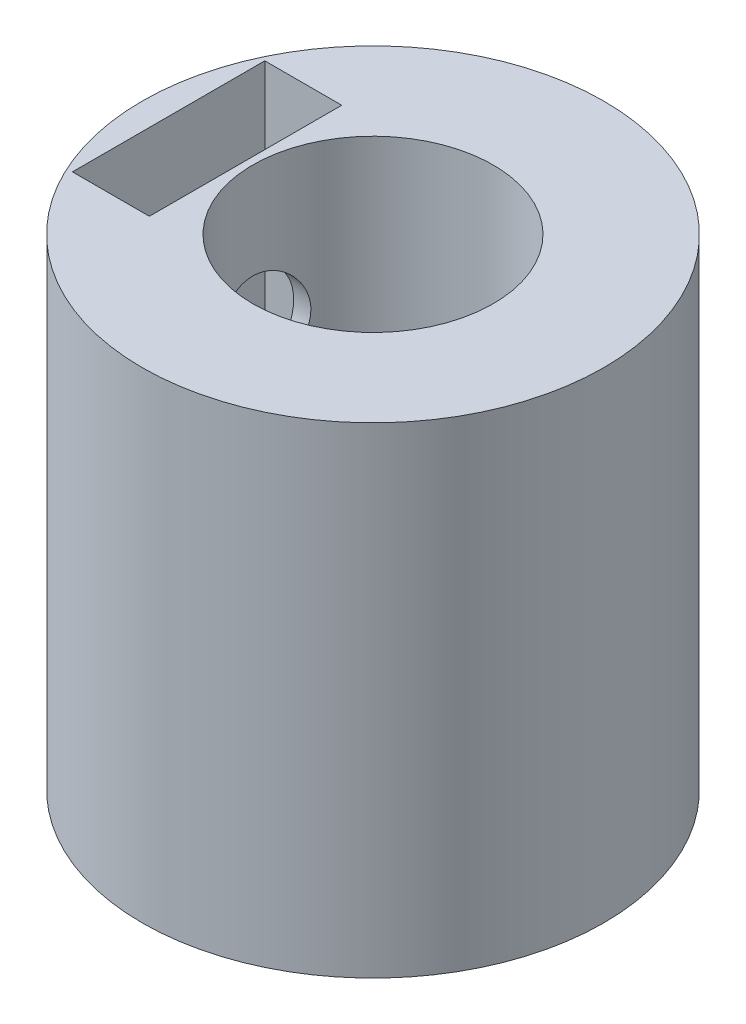
ISO-10303-21;
HEADER;
FILE_DESCRIPTION(('STEP AP214'),'2;1');
FILE_NAME('part.step','',(''),(''),'','','');
FILE_SCHEMA(('AUTOMOTIVE_DESIGN { 1 0 10303 214 1 1 1 1 }'));
ENDSEC;
DATA;
#1=APPLICATION_CONTEXT('core data for automotive mechanical design processes');
#2=APPLICATION_PROTOCOL_DEFINITION('international standard','automotive_design',2000,#1);
#3=PRODUCT_CONTEXT('',#1,'mechanical');
#4=PRODUCT('Part','Part','',(#3));
#5=PRODUCT_RELATED_PRODUCT_CATEGORY('part','',(#4));
#6=PRODUCT_DEFINITION_FORMATION('','',#4);
#7=PRODUCT_DEFINITION_CONTEXT('part definition',#1,'design');
#8=PRODUCT_DEFINITION('design','',#6,#7);
#9=PRODUCT_DEFINITION_SHAPE('','',#8);
#10=(LENGTH_UNIT() NAMED_UNIT(*) SI_UNIT(.MILLI.,.METRE.));
#11=(NAMED_UNIT(*) PLANE_ANGLE_UNIT() SI_UNIT($,.RADIAN.));
#12=(NAMED_UNIT(*) SI_UNIT($,.STERADIAN.) SOLID_ANGLE_UNIT());
#13=UNCERTAINTY_MEASURE_WITH_UNIT(LENGTH_MEASURE(1.E-05),#10,'distance_accuracy_value','');
#14=(GEOMETRIC_REPRESENTATION_CONTEXT(3) GLOBAL_UNCERTAINTY_ASSIGNED_CONTEXT((#13)) GLOBAL_UNIT_ASSIGNED_CONTEXT((#10,
#11,#12)) REPRESENTATION_CONTEXT('',''));
#15=CARTESIAN_POINT('',(0.,0.,0.));
#16=DIRECTION('',(0.,0.,1.));
#17=DIRECTION('',(1.,0.,0.));
#18=AXIS2_PLACEMENT_3D('',#15,#16,#17);
#19=CARTESIAN_POINT('',(-4.8,7.,0.));
#20=DIRECTION('',(1.,0.,0.));
#21=DIRECTION('',(0.,0.,-1.));
#22=AXIS2_PLACEMENT_3D('',#19,#20,#21);
#23=CYLINDRICAL_SURFACE('',#22,1.);
#24=CARTESIAN_POINT('',(-4.25,7.,0.));
#25=DIRECTION('',(-1.,0.,0.));
#26=DIRECTION('',(0.,0.,1.));
#27=AXIS2_PLACEMENT_3D('',#24,#25,#26);
#28=CIRCLE('',#27,1.);
#29=CARTESIAN_POINT('',(-4.25,7.,1.));
#30=VERTEX_POINT('',#29);
#31=EDGE_CURVE('E37',#30,#30,#28,.F.);
#32=ORIENTED_EDGE('',*,*,#31,.T.);
#33=EDGE_LOOP('',(#32));
#34=FACE_BOUND('',#33,.T.);
#35=CARTESIAN_POINT('',(-4.8,6.,0.));
#36=CARTESIAN_POINT('',(-4.79999897221321,6.00000198197538,-0.0555272333613286));
#37=CARTESIAN_POINT('',(-4.79902663020034,6.004640532575,-0.1110790316167));
#38=CARTESIAN_POINT('',(-4.79524160792544,6.02305547962628,-0.220609053013595));
#39=CARTESIAN_POINT('',(-4.79242752951398,6.03683881842954,-0.27458604810265));
#40=CARTESIAN_POINT('',(-4.78527287356961,6.07309636393745,-0.379367305833074));
#41=CARTESIAN_POINT('',(-4.78093381642116,6.09556191679911,-0.430174669367348));
#42=CARTESIAN_POINT('',(-4.77119942247887,6.14851968708494,-0.527296262884767));
#43=CARTESIAN_POINT('',(-4.7658041330078,6.17901154492467,-0.573610694027461));
#44=CARTESIAN_POINT('',(-4.7544616001972,6.24762907215252,-0.661112259447069));
#45=CARTESIAN_POINT('',(-4.74850804678825,6.28584960098806,-0.702224195330148));
#46=CARTESIAN_POINT('',(-4.73676526153958,6.36863572735609,-0.777502221415514));
#47=CARTESIAN_POINT('',(-4.73097604333346,6.41320184949781,-0.811667736768791));
#48=CARTESIAN_POINT('',(-4.72015554076246,6.50796157501293,-0.872408253417735));
#49=CARTESIAN_POINT('',(-4.71513236139862,6.55820670760219,-0.898904437445208));
#50=CARTESIAN_POINT('',(-4.70650272520016,6.6625579614182,-0.94304895478451));
#51=CARTESIAN_POINT('',(-4.70289611574054,6.71666366595403,-0.960698241341131));
#52=CARTESIAN_POINT('',(-4.69757200788898,6.82638818993251,-0.986401921069896));
#53=CARTESIAN_POINT('',(-4.69582845484692,6.88197468746781,-0.994588781574391));
#54=CARTESIAN_POINT('',(-4.69434952573192,6.9937574742901,-1.00154686124492));
#55=CARTESIAN_POINT('',(-4.69461392640785,7.04995369509224,-1.0003191271575));
#56=CARTESIAN_POINT('',(-4.6970973945534,7.16038482238014,-0.988589752297578));
#57=CARTESIAN_POINT('',(-4.6992842694392,7.21463678372897,-0.978240841861763));
#58=CARTESIAN_POINT('',(-4.70531550092753,7.32061720771594,-0.948804348239562));
#59=CARTESIAN_POINT('',(-4.70915994273054,7.37234554048507,-0.929716315851055));
#60=CARTESIAN_POINT('',(-4.71810553171281,7.47224578273278,-0.883200025711427));
#61=CARTESIAN_POINT('',(-4.72321563028468,7.52038903722166,-0.855712020273895));
#62=CARTESIAN_POINT('',(-4.73411112008577,7.61143659541453,-0.793218159419855));
#63=CARTESIAN_POINT('',(-4.7398965951883,7.65434024706878,-0.758211369810071));
#64=CARTESIAN_POINT('',(-4.75162984743927,7.7345711688643,-0.680859937237427));
#65=CARTESIAN_POINT('',(-4.75757858559579,7.77177293511761,-0.638385146729667));
#66=CARTESIAN_POINT('',(-4.76886470514401,7.83854435378318,-0.547733830889438));
#67=CARTESIAN_POINT('',(-4.77420207736189,7.86811389167872,-0.499557220020612));
#68=CARTESIAN_POINT('',(-4.78367896754252,7.91880806522876,-0.398724432988382));
#69=CARTESIAN_POINT('',(-4.78781631768206,7.93991744365369,-0.3460603695412));
#70=CARTESIAN_POINT('',(-4.79441070569025,7.9729533638684,-0.237827696777724));
#71=CARTESIAN_POINT('',(-4.79686796476843,7.98488111458512,-0.182259470876072));
#72=CARTESIAN_POINT('',(-4.79979420172364,7.99903540165431,-0.070873492560669));
#73=CARTESIAN_POINT('',(-4.80029834830063,8.0014335531954,-0.0150784444209438));
#74=CARTESIAN_POINT('',(-4.79935961802219,7.99692404002472,0.0961150390061707));
#75=CARTESIAN_POINT('',(-4.79791686038523,7.99001694511872,0.151513498369806));
#76=CARTESIAN_POINT('',(-4.79326851983347,7.96723547722437,0.25978109369585));
#77=CARTESIAN_POINT('',(-4.79008042294462,7.95145001169323,0.312669754315364));
#78=CARTESIAN_POINT('',(-4.78229781793916,7.91145771166287,0.415049157329064));
#79=CARTESIAN_POINT('',(-4.77770319795663,7.88725020730722,0.46453962906942));
#80=CARTESIAN_POINT('',(-4.76752993192571,7.83073569740995,0.559435445554795));
#81=CARTESIAN_POINT('',(-4.76193915049864,7.79832645634475,0.604778575575867));
#82=CARTESIAN_POINT('',(-4.75042054639767,7.72646434953898,0.689444356709216));
#83=CARTESIAN_POINT('',(-4.74449268434009,7.68701065958485,0.728766302330628));
#84=CARTESIAN_POINT('',(-4.73284819625101,7.60139553840024,0.80094291892144));
#85=CARTESIAN_POINT('',(-4.72713671446001,7.55513357443578,0.833679316801635));
#86=CARTESIAN_POINT('',(-4.71668480812644,7.45766697262897,0.890917752633947));
#87=CARTESIAN_POINT('',(-4.71194434315721,7.40646254068872,0.915420133422913));
#88=CARTESIAN_POINT('',(-4.70401360566433,7.30083104296142,0.955337971551377));
#89=CARTESIAN_POINT('',(-4.7008149822775,7.24642317026733,0.970802478624253));
#90=CARTESIAN_POINT('',(-4.69631347767758,7.13570675960619,0.992352308187258));
#91=CARTESIAN_POINT('',(-4.69501032528293,7.07939849470445,0.998438972355527));
#92=CARTESIAN_POINT('',(-4.69446325846805,6.96766927920028,1.00100741190089));
#93=CARTESIAN_POINT('',(-4.69517921857201,6.91225274382236,0.997676340981803));
#94=CARTESIAN_POINT('',(-4.69849957803942,6.80278879286383,0.981919242512253));
#95=CARTESIAN_POINT('',(-4.70110395927701,6.74874136414712,0.96949330225813));
#96=CARTESIAN_POINT('',(-4.70788905958173,6.64368178248747,0.93598574214868));
#97=CARTESIAN_POINT('',(-4.71206525606344,6.59266140281046,0.914928940547371));
#98=CARTESIAN_POINT('',(-4.7215256459099,6.49484897917867,0.864779658398059));
#99=CARTESIAN_POINT('',(-4.72680994212368,6.4480573282935,0.835686431864239));
#100=CARTESIAN_POINT('',(-4.73801263640917,6.35910269833644,0.769658956273929));
#101=CARTESIAN_POINT('',(-4.74394091094723,6.31704070034801,0.732590312334581));
#102=CARTESIAN_POINT('',(-4.7556947166657,6.23967240541891,0.651939550492268));
#103=CARTESIAN_POINT('',(-4.76152022387904,6.20436766595881,0.608355935066375));
#104=CARTESIAN_POINT('',(-4.7724915563811,6.14112914145275,0.515307542006163));
#105=CARTESIAN_POINT('',(-4.77762876858595,6.11328505609097,0.465780737217079));
#106=CARTESIAN_POINT('',(-4.78655926795274,6.06635981725598,0.362655875198764));
#107=CARTESIAN_POINT('',(-4.79035372945681,6.0472710022545,0.309061425525796));
#108=CARTESIAN_POINT('',(-4.79545999825155,6.02196777736926,0.212812234320084));
#109=CARTESIAN_POINT('',(-4.79715228529116,6.01374498943291,0.170694074982343));
#110=CARTESIAN_POINT('',(-4.79942266231807,6.00276043657813,0.0857221393412294));
#111=CARTESIAN_POINT('',(-4.80000079347669,5.99999846986625,0.0428683902790974));
#112=CARTESIAN_POINT('',(-4.8,6.,0.));
#113=B_SPLINE_CURVE_WITH_KNOTS('',3,(#35,#36,#37,#38,#39,#40,#41,#42,#43,#44,#45,#46,#47,#48,
#49,#50,#51,#52,#53,#54,#55,#56,#57,#58,#59,#60,#61,#62,#63,#64,#65,#66,#67,#68,#69,#70,#71,#72,
#73,#74,#75,#76,#77,#78,#79,#80,#81,#82,#83,#84,#85,#86,#87,#88,#89,#90,#91,#92,#93,#94,#95,#96,
#97,#98,#99,#100,#101,#102,#103,#104,#105,#106,#107,#108,#109,#110,#111,#112),.UNSPECIFIED.,.T.,
.F.,(4,2,2,2,2,2,2,2,2,2,2,2,2,2,2,2,2,2,2,2,2,2,2,2,2,2,2,2,2,2,2,2,2,2,2,2,2,2,4),(0.,
0.166424836082547,0.33297615992498,0.499361903060354,0.665740193258392,0.834300211104981,
1.00287417241429,1.17312359342839,1.34335466628392,1.51117260135883,1.67897187813732,
1.84401369703248,2.00906400024224,2.17531673933399,2.34159014694428,2.51111621084373,
2.68064481822575,2.8504777959973,3.02028840836617,3.18702671526141,3.35375481241822,
3.51884229306097,3.68394290712747,3.8512126719659,4.01850202051659,4.18857011063469,
4.35863111881048,4.5277604007602,4.69686548331348,4.86263378632831,5.02840049825089,
5.19369385114604,5.35900255265184,5.52735219864247,5.69574060093896,5.86607091518605,
6.03625189171979,6.16474070781824,6.29322477578713),.UNSPECIFIED.);
#114=CARTESIAN_POINT('',(-4.8,6.,0.));
#115=VERTEX_POINT('',#114);
#116=EDGE_CURVE('E115',#115,#115,#113,.T.);
#117=ORIENTED_EDGE('',*,*,#116,.F.);
#118=EDGE_LOOP('',(#117));
#119=FACE_BOUND('',#118,.T.);
#120=ADVANCED_FACE('F32',(#34,#119),#23,.F.);
#121=CARTESIAN_POINT('',(0.,10.,0.));
#122=DIRECTION('',(0.,-1.,0.));
#123=DIRECTION('',(0.,0.,-1.));
#124=AXIS2_PLACEMENT_3D('',#121,#122,#123);
#125=CYLINDRICAL_SURFACE('',#124,4.8);
#126=ORIENTED_EDGE('',*,*,#116,.T.);
#127=EDGE_LOOP('',(#126));
#128=FACE_BOUND('',#127,.T.);
#129=CARTESIAN_POINT('',(0.,10.,0.));
#130=DIRECTION('',(0.,1.,0.));
#131=DIRECTION('',(0.,0.,1.));
#132=AXIS2_PLACEMENT_3D('',#129,#130,#131);
#133=CIRCLE('',#132,4.8);
#134=CARTESIAN_POINT('',(0.,10.,4.8));
#135=VERTEX_POINT('',#134);
#136=EDGE_CURVE('E11',#135,#135,#133,.T.);
#137=ORIENTED_EDGE('',*,*,#136,.F.);
#138=EDGE_LOOP('',(#137));
#139=FACE_BOUND('',#138,.T.);
#140=CARTESIAN_POINT('',(0.,0.,0.));
#141=DIRECTION('',(0.,1.,0.));
#142=DIRECTION('',(0.,0.,1.));
#143=AXIS2_PLACEMENT_3D('',#140,#141,#142);
#144=CIRCLE('',#143,4.8);
#145=CARTESIAN_POINT('',(0.,0.,4.8));
#146=VERTEX_POINT('',#145);
#147=EDGE_CURVE('E42',#146,#146,#144,.T.);
#148=ORIENTED_EDGE('',*,*,#147,.T.);
#149=EDGE_LOOP('',(#148));
#150=FACE_BOUND('',#149,.T.);
#151=ADVANCED_FACE('F34',(#128,#139,#150),#125,.T.);
#152=CARTESIAN_POINT('',(0.,10.,0.));
#153=DIRECTION('',(0.,1.,0.));
#154=DIRECTION('',(0.,0.,1.));
#155=AXIS2_PLACEMENT_3D('',#152,#153,#154);
#156=PLANE('',#155);
#157=DIRECTION('',(0.,0.,1.));
#158=VECTOR('',#157,1.);
#159=CARTESIAN_POINT('',(-4.25,10.,-2.));
#160=LINE('',#159,#158);
#161=CARTESIAN_POINT('',(-4.25,10.,-2.));
#162=VERTEX_POINT('',#161);
#163=CARTESIAN_POINT('',(-4.25,10.,2.));
#164=VERTEX_POINT('',#163);
#165=EDGE_CURVE('E50',#162,#164,#160,.T.);
#166=ORIENTED_EDGE('',*,*,#165,.F.);
#167=DIRECTION('',(-1.,0.,0.));
#168=VECTOR('',#167,1.);
#169=CARTESIAN_POINT('',(-4.25,10.,-2.));
#170=LINE('',#169,#168);
#171=CARTESIAN_POINT('',(-2.65,10.,-2.));
#172=VERTEX_POINT('',#171);
#173=EDGE_CURVE('E102',#172,#162,#170,.T.);
#174=ORIENTED_EDGE('',*,*,#173,.F.);
#175=DIRECTION('',(0.,0.,-1.));
#176=VECTOR('',#175,1.);
#177=CARTESIAN_POINT('',(-2.65,10.,-2.));
#178=LINE('',#177,#176);
#179=CARTESIAN_POINT('',(-2.65,10.,2.));
#180=VERTEX_POINT('',#179);
#181=EDGE_CURVE('E108',#180,#172,#178,.T.);
#182=ORIENTED_EDGE('',*,*,#181,.F.);
#183=DIRECTION('',(1.,0.,0.));
#184=VECTOR('',#183,1.);
#185=CARTESIAN_POINT('',(-4.25,10.,2.));
#186=LINE('',#185,#184);
#187=EDGE_CURVE('E85',#164,#180,#186,.T.);
#188=ORIENTED_EDGE('',*,*,#187,.F.);
#189=EDGE_LOOP('',(#166,#174,#182,#188));
#190=FACE_BOUND('',#189,.T.);
#191=CARTESIAN_POINT('',(0.,10.,0.));
#192=DIRECTION('',(0.,1.,0.));
#193=DIRECTION('',(0.,0.,1.));
#194=AXIS2_PLACEMENT_3D('',#191,#192,#193);
#195=CIRCLE('',#194,2.5);
#196=CARTESIAN_POINT('',(0.,10.,2.5));
#197=VERTEX_POINT('',#196);
#198=EDGE_CURVE('E122',#197,#197,#195,.T.);
#199=ORIENTED_EDGE('',*,*,#198,.F.);
#200=EDGE_LOOP('',(#199));
#201=FACE_BOUND('',#200,.T.);
#202=ORIENTED_EDGE('',*,*,#136,.T.);
#203=EDGE_LOOP('',(#202));
#204=FACE_BOUND('',#203,.T.);
#205=ADVANCED_FACE('F149',(#190,#201,#204),#156,.T.);
#206=CARTESIAN_POINT('',(0.,0.,0.));
#207=DIRECTION('',(0.,1.,0.));
#208=DIRECTION('',(0.,0.,1.));
#209=AXIS2_PLACEMENT_3D('',#206,#207,#208);
#210=PLANE('',#209);
#211=ORIENTED_EDGE('',*,*,#147,.F.);
#212=EDGE_LOOP('',(#211));
#213=FACE_BOUND('',#212,.T.);
#214=ADVANCED_FACE('F147',(#213),#210,.F.);
#215=CARTESIAN_POINT('',(0.,3.,0.));
#216=DIRECTION('',(0.,1.,0.));
#217=DIRECTION('',(0.,0.,1.));
#218=AXIS2_PLACEMENT_3D('',#215,#216,#217);
#219=CYLINDRICAL_SURFACE('',#218,2.5);
#220=CARTESIAN_POINT('',(-2.29128784747792,7.,-1.));
#221=CARTESIAN_POINT('',(-2.29129325828211,6.94643025095005,-0.999994127101894));
#222=CARTESIAN_POINT('',(-2.29319301242133,6.89278473264765,-0.995669909297176));
#223=CARTESIAN_POINT('',(-2.30055457093922,6.78703258356147,-0.978534515296365));
#224=CARTESIAN_POINT('',(-2.30602547693426,6.73493024145976,-0.965701652221065));
#225=CARTESIAN_POINT('',(-2.31980227895648,6.63397352901498,-0.932117516284352));
#226=CARTESIAN_POINT('',(-2.32809748178557,6.58510772631987,-0.911396076262712));
#227=CARTESIAN_POINT('',(-2.3465733254764,6.49155747457019,-0.862710134685805));
#228=CARTESIAN_POINT('',(-2.35675355451961,6.44687211542457,-0.83474721463375));
#229=CARTESIAN_POINT('',(-2.37850432525516,6.36036979887927,-0.77066098729371));
#230=CARTESIAN_POINT('',(-2.39011958979373,6.31882178853527,-0.734189678863664));
#231=CARTESIAN_POINT('',(-2.41306228489405,6.24223550134231,-0.654854552887022));
#232=CARTESIAN_POINT('',(-2.42438961368186,6.20719949935507,-0.61198851083784));
#233=CARTESIAN_POINT('',(-2.44601703953427,6.14329680150865,-0.519003155178189));
#234=CARTESIAN_POINT('',(-2.45625901841784,6.11472784926468,-0.468664482806141));
#235=CARTESIAN_POINT('',(-2.47401963815773,6.0665782158051,-0.36341266143756));
#236=CARTESIAN_POINT('',(-2.48153938692337,6.04699387710903,-0.308501384643981));
#237=CARTESIAN_POINT('',(-2.49269162504142,6.0183292567813,-0.198483213419446));
#238=CARTESIAN_POINT('',(-2.49649468387678,6.00878634295549,-0.143514492402303));
#239=CARTESIAN_POINT('',(-2.50040155341352,5.99898575716865,-0.0326331643188259));
#240=CARTESIAN_POINT('',(-2.50050674384656,5.99872462203258,0.0232790829127011));
#241=CARTESIAN_POINT('',(-2.49710981410893,6.00724138488749,0.131116247357656));
#242=CARTESIAN_POINT('',(-2.49380998385918,6.01551238637347,0.183088726437017));
#243=CARTESIAN_POINT('',(-2.48424645734395,6.03999643815538,0.284836554609169));
#244=CARTESIAN_POINT('',(-2.47798254360556,6.05621007120019,0.334611742195079));
#245=CARTESIAN_POINT('',(-2.4629841222885,6.09631824143815,0.431448969255828));
#246=CARTESIAN_POINT('',(-2.454213802334,6.12032485740777,0.478458811689817));
#247=CARTESIAN_POINT('',(-2.43507292589849,6.17523250345951,0.567904075370287));
#248=CARTESIAN_POINT('',(-2.42470182132537,6.20613589654881,0.610337921358054));
#249=CARTESIAN_POINT('',(-2.40260818589167,6.2763245679733,0.692384413996076));
#250=CARTESIAN_POINT('',(-2.3908416326012,6.31602694629192,0.731628922636821));
#251=CARTESIAN_POINT('',(-2.36780830482389,6.40149528591048,0.803053707692663));
#252=CARTESIAN_POINT('',(-2.35654169488174,6.44726322407708,0.835231671879828));
#253=CARTESIAN_POINT('',(-2.33548448720906,6.54520951120448,0.892452094371466));
#254=CARTESIAN_POINT('',(-2.3257445709069,6.59753241524191,0.917267325867452));
#255=CARTESIAN_POINT('',(-2.30943795233662,6.70610774523101,0.957588129983133));
#256=CARTESIAN_POINT('',(-2.3028691896167,6.76235759238542,0.9730997492022));
#257=CARTESIAN_POINT('',(-2.29414879836282,6.87351788871803,0.993477474415979));
#258=CARTESIAN_POINT('',(-2.29175183224038,6.92830022356008,0.998936048404205));
#259=CARTESIAN_POINT('',(-2.29094748938549,7.03803860388398,1.00078066322451));
#260=CARTESIAN_POINT('',(-2.29253890281232,7.09299459163892,0.997169455296441));
#261=CARTESIAN_POINT('',(-2.29928022178566,7.19822946747744,0.981516447394262));
#262=CARTESIAN_POINT('',(-2.30422228898885,7.24859646869975,0.969966531011728));
#263=CARTESIAN_POINT('',(-2.31685025513936,7.346644202393,0.939402093455638));
#264=CARTESIAN_POINT('',(-2.32453676244372,7.39432433655366,0.920385917151196));
#265=CARTESIAN_POINT('',(-2.34216890929975,7.48780117889774,0.874567819740727));
#266=CARTESIAN_POINT('',(-2.35219352319567,7.53344309434723,0.847481434132297));
#267=CARTESIAN_POINT('',(-2.37325192578919,7.61974149372083,0.786582612220937));
#268=CARTESIAN_POINT('',(-2.38428612448031,7.6603959363978,0.752767436740991));
#269=CARTESIAN_POINT('',(-2.40710457985699,7.73868670429961,0.676422105840241));
#270=CARTESIAN_POINT('',(-2.41888403642601,7.77587828264551,0.633432714722548));
#271=CARTESIAN_POINT('',(-2.44109897283781,7.84258853830517,0.541541816684421));
#272=CARTESIAN_POINT('',(-2.4515343979662,7.87210690329862,0.492640069233931));
#273=CARTESIAN_POINT('',(-2.46991857950143,7.92252381323061,0.390139967000879));
#274=CARTESIAN_POINT('',(-2.47786793120137,7.94342442208289,0.336542740497031));
#275=CARTESIAN_POINT('',(-2.49036356734645,7.97577442620381,0.226196795459611));
#276=CARTESIAN_POINT('',(-2.49491169853772,7.98722895072003,0.169449805147133));
#277=CARTESIAN_POINT('',(-2.49989504105256,7.99975235081269,0.0584082551731507));
#278=CARTESIAN_POINT('',(-2.50057923372437,8.00145006423132,0.00419524629652693));
#279=CARTESIAN_POINT('',(-2.49843021189296,7.99607226035795,-0.103716917866622));
#280=CARTESIAN_POINT('',(-2.49559752983456,7.98899807110719,-0.157416149697311));
#281=CARTESIAN_POINT('',(-2.48685756682127,7.96672660582076,-0.261085450973206));
#282=CARTESIAN_POINT('',(-2.48104740317165,7.95178552696222,-0.311119402324194));
#283=CARTESIAN_POINT('',(-2.46697473916019,7.91447359771909,-0.407961177379471));
#284=CARTESIAN_POINT('',(-2.45871178652006,7.89210137698983,-0.454768404133639));
#285=CARTESIAN_POINT('',(-2.44009047180029,7.83944840075533,-0.546101520928058));
#286=CARTESIAN_POINT('',(-2.42965564864115,7.80886185255746,-0.590435193403212));
#287=CARTESIAN_POINT('',(-2.40794701593224,7.74110574041053,-0.673527014262036));
#288=CARTESIAN_POINT('',(-2.3966728602525,7.70393345176994,-0.712282842872878));
#289=CARTESIAN_POINT('',(-2.37368881779711,7.62134238773747,-0.785600632542996));
#290=CARTESIAN_POINT('',(-2.36199516302692,7.57555556329945,-0.819754443599515));
#291=CARTESIAN_POINT('',(-2.3402483573759,7.47852893128561,-0.879923725219699));
#292=CARTESIAN_POINT('',(-2.33019539943728,7.42728848354507,-0.905938238949995));
#293=CARTESIAN_POINT('',(-2.31379432228954,7.32548139907597,-0.946995543836655));
#294=CARTESIAN_POINT('',(-2.30719459305824,7.27526738262441,-0.962813757082103));
#295=CARTESIAN_POINT('',(-2.29723001801982,7.17275729018483,-0.986358878909192));
#296=CARTESIAN_POINT('',(-2.29385616036088,7.12046744201652,-0.994108333944007));
#297=CARTESIAN_POINT('',(-2.29162229378817,7.04531121883104,-0.999232129155086));
#298=CARTESIAN_POINT('',(-2.29128555846679,7.0226623895012,-1.00000248449744));
#299=CARTESIAN_POINT('',(-2.29128784747792,7.,-1.));
#300=B_SPLINE_CURVE_WITH_KNOTS('',3,(#220,#221,#222,#223,#224,#225,#226,#227,#228,#229,#230,
#231,#232,#233,#234,#235,#236,#237,#238,#239,#240,#241,#242,#243,#244,#245,#246,#247,#248,#249,
#250,#251,#252,#253,#254,#255,#256,#257,#258,#259,#260,#261,#262,#263,#264,#265,#266,#267,#268,
#269,#270,#271,#272,#273,#274,#275,#276,#277,#278,#279,#280,#281,#282,#283,#284,#285,#286,#287,
#288,#289,#290,#291,#292,#293,#294,#295,#296,#297,#298,#299),.UNSPECIFIED.,.T.,.F.,(4,2,2,2,2,2,
2,2,2,2,2,2,2,2,2,2,2,2,2,2,2,2,2,2,2,2,2,2,2,2,2,2,2,2,2,2,2,2,2,4),(0.,0.160638824383827,
0.321688667911123,0.482135411646695,0.642547144119307,0.811278091422124,0.980067871741712,
1.15551334545714,1.3308873348474,1.49777091443592,1.66459222652836,1.82204322415151,
1.9795057756453,2.13934150117449,2.29923207470016,2.46962022040678,2.64006403563563,
2.81532229357288,2.99046652397056,3.15491073759215,3.31930507450975,3.47433624039577,
3.62940179322824,3.79075577323355,3.9521755725993,4.12551867120495,4.29886882423379,
4.47217743653411,4.64539187974073,4.80730519874981,4.96919400753306,5.12610997218681,
5.28305488911298,5.44693525566967,5.61088358279108,5.78498126639812,5.95909940876599,
6.11758330406543,6.27562315106627,6.34358052760367),.UNSPECIFIED.);
#301=CARTESIAN_POINT('',(-2.29128784747792,7.,-1.));
#302=VERTEX_POINT('',#301);
#303=EDGE_CURVE('E123',#302,#302,#300,.T.);
#304=ORIENTED_EDGE('',*,*,#303,.T.);
#305=EDGE_LOOP('',(#304));
#306=FACE_BOUND('',#305,.T.);
#307=CARTESIAN_POINT('',(0.,3.,0.));
#308=DIRECTION('',(0.,1.,0.));
#309=DIRECTION('',(0.,0.,1.));
#310=AXIS2_PLACEMENT_3D('',#307,#308,#309);
#311=CIRCLE('',#310,2.5);
#312=CARTESIAN_POINT('',(0.,3.,2.5));
#313=VERTEX_POINT('',#312);
#314=EDGE_CURVE('E124',#313,#313,#311,.T.);
#315=ORIENTED_EDGE('',*,*,#314,.F.);
#316=EDGE_LOOP('',(#315));
#317=FACE_BOUND('',#316,.T.);
#318=ORIENTED_EDGE('',*,*,#198,.T.);
#319=EDGE_LOOP('',(#318));
#320=FACE_BOUND('',#319,.T.);
#321=ADVANCED_FACE('F143',(#306,#317,#320),#219,.F.);
#322=CARTESIAN_POINT('',(0.,3.,0.));
#323=DIRECTION('',(0.,1.,0.));
#324=DIRECTION('',(0.,0.,1.));
#325=AXIS2_PLACEMENT_3D('',#322,#323,#324);
#326=PLANE('',#325);
#327=ORIENTED_EDGE('',*,*,#314,.T.);
#328=EDGE_LOOP('',(#327));
#329=FACE_BOUND('',#328,.T.);
#330=ADVANCED_FACE('F132',(#329),#326,.T.);
#331=CARTESIAN_POINT('',(-2.65,7.,0.));
#332=DIRECTION('',(1.,0.,0.));
#333=DIRECTION('',(0.,0.,-1.));
#334=AXIS2_PLACEMENT_3D('',#331,#332,#333);
#335=CIRCLE('',#334,1.);
#336=CARTESIAN_POINT('',(-2.65,7.,-1.));
#337=VERTEX_POINT('',#336);
#338=EDGE_CURVE('E112',#337,#337,#335,.F.);
#339=ORIENTED_EDGE('',*,*,#338,.T.);
#340=EDGE_LOOP('',(#339));
#341=FACE_BOUND('',#340,.T.);
#342=ORIENTED_EDGE('',*,*,#303,.F.);
#343=EDGE_LOOP('',(#342));
#344=FACE_BOUND('',#343,.T.);
#345=ADVANCED_FACE('F126',(#341,#344),#23,.F.);
#346=CARTESIAN_POINT('',(-4.25,5.,-2.));
#347=DIRECTION('',(-1.,0.,0.));
#348=DIRECTION('',(0.,0.,1.));
#349=AXIS2_PLACEMENT_3D('',#346,#347,#348);
#350=PLANE('',#349);
#351=ORIENTED_EDGE('',*,*,#165,.T.);
#352=DIRECTION('',(0.,1.,0.));
#353=VECTOR('',#352,1.);
#354=CARTESIAN_POINT('',(-4.25,5.,2.));
#355=LINE('',#354,#353);
#356=CARTESIAN_POINT('',(-4.25,5.,2.));
#357=VERTEX_POINT('',#356);
#358=EDGE_CURVE('E73',#357,#164,#355,.T.);
#359=ORIENTED_EDGE('',*,*,#358,.F.);
#360=DIRECTION('',(0.,0.,1.));
#361=VECTOR('',#360,1.);
#362=CARTESIAN_POINT('',(-4.25,5.,-2.));
#363=LINE('',#362,#361);
#364=CARTESIAN_POINT('',(-4.25,5.,-2.));
#365=VERTEX_POINT('',#364);
#366=EDGE_CURVE('E100',#365,#357,#363,.T.);
#367=ORIENTED_EDGE('',*,*,#366,.F.);
#368=DIRECTION('',(0.,1.,0.));
#369=VECTOR('',#368,1.);
#370=CARTESIAN_POINT('',(-4.25,5.,-2.));
#371=LINE('',#370,#369);
#372=EDGE_CURVE('E58',#365,#162,#371,.T.);
#373=ORIENTED_EDGE('',*,*,#372,.T.);
#374=EDGE_LOOP('',(#351,#359,#367,#373));
#375=FACE_BOUND('',#374,.T.);
#376=ORIENTED_EDGE('',*,*,#31,.F.);
#377=EDGE_LOOP('',(#376));
#378=FACE_BOUND('',#377,.T.);
#379=ADVANCED_FACE('F131',(#375,#378),#350,.F.);
#380=CARTESIAN_POINT('',(-2.65,5.,-2.));
#381=DIRECTION('',(1.,0.,0.));
#382=DIRECTION('',(0.,0.,-1.));
#383=AXIS2_PLACEMENT_3D('',#380,#381,#382);
#384=PLANE('',#383);
#385=ORIENTED_EDGE('',*,*,#181,.T.);
#386=DIRECTION('',(0.,1.,0.));
#387=VECTOR('',#386,1.);
#388=CARTESIAN_POINT('',(-2.65,5.,-2.));
#389=LINE('',#388,#387);
#390=CARTESIAN_POINT('',(-2.65,5.,-2.));
#391=VERTEX_POINT('',#390);
#392=EDGE_CURVE('E89',#391,#172,#389,.T.);
#393=ORIENTED_EDGE('',*,*,#392,.F.);
#394=DIRECTION('',(0.,0.,-1.));
#395=VECTOR('',#394,1.);
#396=CARTESIAN_POINT('',(-2.65,5.,-2.));
#397=LINE('',#396,#395);
#398=CARTESIAN_POINT('',(-2.65,5.,2.));
#399=VERTEX_POINT('',#398);
#400=EDGE_CURVE('E92',#399,#391,#397,.T.);
#401=ORIENTED_EDGE('',*,*,#400,.F.);
#402=DIRECTION('',(0.,1.,0.));
#403=VECTOR('',#402,1.);
#404=CARTESIAN_POINT('',(-2.65,5.,2.));
#405=LINE('',#404,#403);
#406=EDGE_CURVE('E78',#399,#180,#405,.T.);
#407=ORIENTED_EDGE('',*,*,#406,.T.);
#408=EDGE_LOOP('',(#385,#393,#401,#407));
#409=FACE_BOUND('',#408,.T.);
#410=ORIENTED_EDGE('',*,*,#338,.F.);
#411=EDGE_LOOP('',(#410));
#412=FACE_BOUND('',#411,.T.);
#413=ADVANCED_FACE('F93',(#409,#412),#384,.F.);
#414=CARTESIAN_POINT('',(-4.25,5.,-2.));
#415=DIRECTION('',(0.,0.,-1.));
#416=DIRECTION('',(-1.,0.,0.));
#417=AXIS2_PLACEMENT_3D('',#414,#415,#416);
#418=PLANE('',#417);
#419=ORIENTED_EDGE('',*,*,#173,.T.);
#420=ORIENTED_EDGE('',*,*,#372,.F.);
#421=DIRECTION('',(-1.,0.,0.));
#422=VECTOR('',#421,1.);
#423=CARTESIAN_POINT('',(-4.25,5.,-2.));
#424=LINE('',#423,#422);
#425=EDGE_CURVE('E97',#391,#365,#424,.T.);
#426=ORIENTED_EDGE('',*,*,#425,.F.);
#427=ORIENTED_EDGE('',*,*,#392,.T.);
#428=EDGE_LOOP('',(#419,#420,#426,#427));
#429=FACE_BOUND('',#428,.T.);
#430=ADVANCED_FACE('F202',(#429),#418,.F.);
#431=CARTESIAN_POINT('',(-4.25,5.,2.));
#432=DIRECTION('',(0.,0.,1.));
#433=DIRECTION('',(1.,0.,0.));
#434=AXIS2_PLACEMENT_3D('',#431,#432,#433);
#435=PLANE('',#434);
#436=ORIENTED_EDGE('',*,*,#187,.T.);
#437=ORIENTED_EDGE('',*,*,#406,.F.);
#438=DIRECTION('',(1.,0.,0.));
#439=VECTOR('',#438,1.);
#440=CARTESIAN_POINT('',(-4.25,5.,2.));
#441=LINE('',#440,#439);
#442=EDGE_CURVE('E82',#357,#399,#441,.T.);
#443=ORIENTED_EDGE('',*,*,#442,.F.);
#444=ORIENTED_EDGE('',*,*,#358,.T.);
#445=EDGE_LOOP('',(#436,#437,#443,#444));
#446=FACE_BOUND('',#445,.T.);
#447=ADVANCED_FACE('F80',(#446),#435,.F.);
#448=CARTESIAN_POINT('',(0.,5.,0.));
#449=DIRECTION('',(0.,1.,0.));
#450=DIRECTION('',(0.,0.,1.));
#451=AXIS2_PLACEMENT_3D('',#448,#449,#450);
#452=PLANE('',#451);
#453=ORIENTED_EDGE('',*,*,#366,.T.);
#454=ORIENTED_EDGE('',*,*,#442,.T.);
#455=ORIENTED_EDGE('',*,*,#400,.T.);
#456=ORIENTED_EDGE('',*,*,#425,.T.);
#457=EDGE_LOOP('',(#453,#454,#455,#456));
#458=FACE_BOUND('',#457,.T.);
#459=ADVANCED_FACE('F99',(#458),#452,.T.);
#460=CLOSED_SHELL('',(#120,#151,#205,#214,#321,#330,#345,#379,#413,#430,#447,#459));
#461=MANIFOLD_SOLID_BREP('B2',#460);
#462=ADVANCED_BREP_SHAPE_REPRESENTATION('',(#18,#461),#14);
#463=SHAPE_DEFINITION_REPRESENTATION(#9,#462);
ENDSEC;
END-ISO-10303-21;
